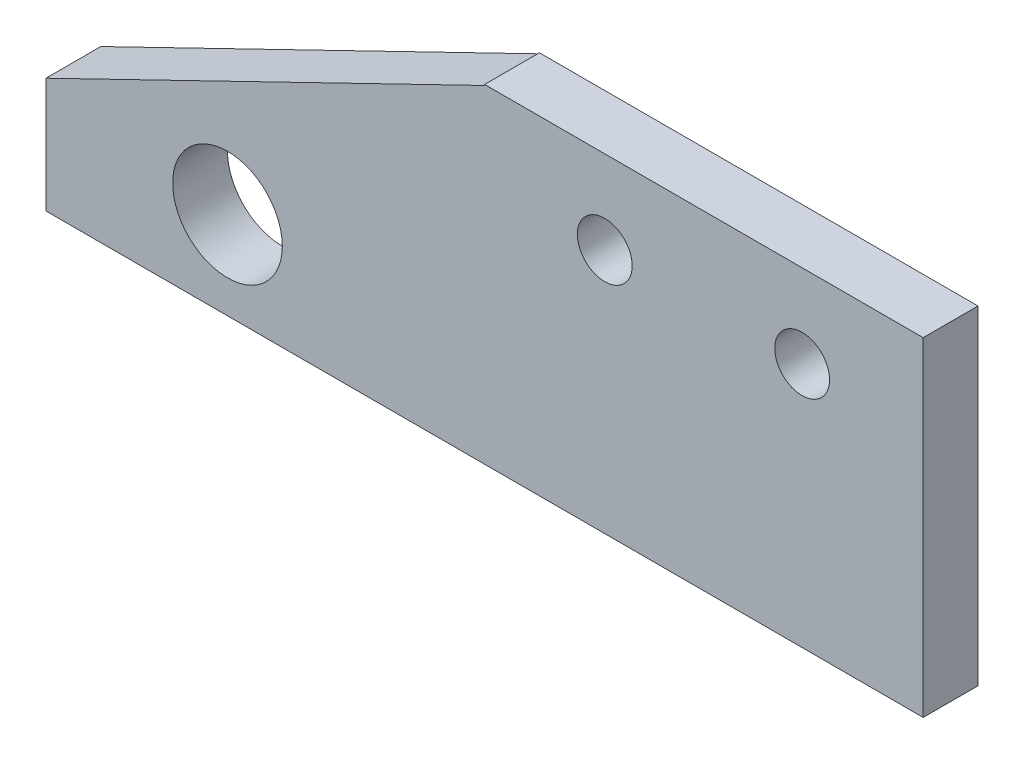
ISO-10303-21;
HEADER;
FILE_DESCRIPTION(('STEP AP214'),'2;1');
FILE_NAME('part.step','',(''),(''),'','','');
FILE_SCHEMA(('AUTOMOTIVE_DESIGN { 1 0 10303 214 1 1 1 1 }'));
ENDSEC;
DATA;
#1=APPLICATION_CONTEXT('core data for automotive mechanical design processes');
#2=APPLICATION_PROTOCOL_DEFINITION('international standard','automotive_design',2000,#1);
#3=PRODUCT_CONTEXT('',#1,'mechanical');
#4=PRODUCT('Part','Part','',(#3));
#5=PRODUCT_RELATED_PRODUCT_CATEGORY('part','',(#4));
#6=PRODUCT_DEFINITION_FORMATION('','',#4);
#7=PRODUCT_DEFINITION_CONTEXT('part definition',#1,'design');
#8=PRODUCT_DEFINITION('design','',#6,#7);
#9=PRODUCT_DEFINITION_SHAPE('','',#8);
#10=(LENGTH_UNIT() NAMED_UNIT(*) SI_UNIT(.MILLI.,.METRE.));
#11=(NAMED_UNIT(*) PLANE_ANGLE_UNIT() SI_UNIT($,.RADIAN.));
#12=(NAMED_UNIT(*) SI_UNIT($,.STERADIAN.) SOLID_ANGLE_UNIT());
#13=UNCERTAINTY_MEASURE_WITH_UNIT(LENGTH_MEASURE(1.E-05),#10,'distance_accuracy_value','');
#14=(GEOMETRIC_REPRESENTATION_CONTEXT(3) GLOBAL_UNCERTAINTY_ASSIGNED_CONTEXT((#13)) GLOBAL_UNIT_ASSIGNED_CONTEXT((#10,
#11,#12)) REPRESENTATION_CONTEXT('',''));
#15=CARTESIAN_POINT('',(0.,0.,0.));
#16=DIRECTION('',(0.,0.,1.));
#17=DIRECTION('',(1.,0.,0.));
#18=AXIS2_PLACEMENT_3D('',#15,#16,#17);
#19=CARTESIAN_POINT('',(0.,-9.525,3.175));
#20=DIRECTION('',(0.,-1.,0.));
#21=DIRECTION('',(1.,0.,0.));
#22=AXIS2_PLACEMENT_3D('',#19,#20,#21);
#23=PLANE('',#22);
#24=DIRECTION('',(-1.,0.,0.));
#25=VECTOR('',#24,1.);
#26=CARTESIAN_POINT('',(0.,-9.525,0.));
#27=LINE('',#26,#25);
#28=CARTESIAN_POINT('',(12.7,-9.525,0.));
#29=VERTEX_POINT('',#28);
#30=CARTESIAN_POINT('',(-38.1,-9.525,0.));
#31=VERTEX_POINT('',#30);
#32=EDGE_CURVE('E131',#29,#31,#27,.T.);
#33=ORIENTED_EDGE('',*,*,#32,.F.);
#34=DIRECTION('',(0.,0.,-1.));
#35=VECTOR('',#34,1.);
#36=CARTESIAN_POINT('',(12.7,-9.525,3.175));
#37=LINE('',#36,#35);
#38=CARTESIAN_POINT('',(12.7,-9.525,3.175));
#39=VERTEX_POINT('',#38);
#40=EDGE_CURVE('E11',#39,#29,#37,.T.);
#41=ORIENTED_EDGE('',*,*,#40,.F.);
#42=DIRECTION('',(-1.,0.,0.));
#43=VECTOR('',#42,1.);
#44=CARTESIAN_POINT('',(0.,-9.525,3.175));
#45=LINE('',#44,#43);
#46=CARTESIAN_POINT('',(-38.1,-9.525,3.175));
#47=VERTEX_POINT('',#46);
#48=EDGE_CURVE('E193',#39,#47,#45,.T.);
#49=ORIENTED_EDGE('',*,*,#48,.T.);
#50=DIRECTION('',(0.,0.,-1.));
#51=VECTOR('',#50,1.);
#52=CARTESIAN_POINT('',(-38.1,-9.525,3.175));
#53=LINE('',#52,#51);
#54=EDGE_CURVE('E80',#47,#31,#53,.T.);
#55=ORIENTED_EDGE('',*,*,#54,.T.);
#56=EDGE_LOOP('',(#33,#41,#49,#55));
#57=FACE_BOUND('',#56,.T.);
#58=ADVANCED_FACE('F35',(#57),#23,.T.);
#59=CARTESIAN_POINT('',(12.7,0.,3.175));
#60=DIRECTION('',(1.,0.,0.));
#61=DIRECTION('',(0.,1.,0.));
#62=AXIS2_PLACEMENT_3D('',#59,#60,#61);
#63=PLANE('',#62);
#64=DIRECTION('',(0.,-1.,0.));
#65=VECTOR('',#64,1.);
#66=CARTESIAN_POINT('',(12.7,0.,0.));
#67=LINE('',#66,#65);
#68=CARTESIAN_POINT('',(12.7,9.525,0.));
#69=VERTEX_POINT('',#68);
#70=EDGE_CURVE('E129',#69,#29,#67,.T.);
#71=ORIENTED_EDGE('',*,*,#70,.F.);
#72=DIRECTION('',(0.,0.,-1.));
#73=VECTOR('',#72,1.);
#74=CARTESIAN_POINT('',(12.7,9.525,3.175));
#75=LINE('',#74,#73);
#76=CARTESIAN_POINT('',(12.7,9.525,3.175));
#77=VERTEX_POINT('',#76);
#78=EDGE_CURVE('E44',#77,#69,#75,.T.);
#79=ORIENTED_EDGE('',*,*,#78,.F.);
#80=DIRECTION('',(0.,-1.,0.));
#81=VECTOR('',#80,1.);
#82=CARTESIAN_POINT('',(12.7,0.,3.175));
#83=LINE('',#82,#81);
#84=EDGE_CURVE('E195',#77,#39,#83,.T.);
#85=ORIENTED_EDGE('',*,*,#84,.T.);
#86=ORIENTED_EDGE('',*,*,#40,.T.);
#87=EDGE_LOOP('',(#71,#79,#85,#86));
#88=FACE_BOUND('',#87,.T.);
#89=ADVANCED_FACE('F130',(#88),#63,.T.);
#90=CARTESIAN_POINT('',(0.,9.525,3.175));
#91=DIRECTION('',(0.,1.,0.));
#92=DIRECTION('',(0.,0.,1.));
#93=AXIS2_PLACEMENT_3D('',#90,#91,#92);
#94=PLANE('',#93);
#95=DIRECTION('',(1.,0.,0.));
#96=VECTOR('',#95,1.);
#97=CARTESIAN_POINT('',(0.,9.525,0.));
#98=LINE('',#97,#96);
#99=CARTESIAN_POINT('',(-12.7,9.525,0.));
#100=VERTEX_POINT('',#99);
#101=EDGE_CURVE('E125',#100,#69,#98,.T.);
#102=ORIENTED_EDGE('',*,*,#101,.F.);
#103=DIRECTION('',(0.,0.,-1.));
#104=VECTOR('',#103,1.);
#105=CARTESIAN_POINT('',(-12.7,9.525,3.175));
#106=LINE('',#105,#104);
#107=CARTESIAN_POINT('',(-12.7,9.525,3.175));
#108=VERTEX_POINT('',#107);
#109=EDGE_CURVE('E115',#108,#100,#106,.T.);
#110=ORIENTED_EDGE('',*,*,#109,.F.);
#111=DIRECTION('',(1.,0.,0.));
#112=VECTOR('',#111,1.);
#113=CARTESIAN_POINT('',(0.,9.525,3.175));
#114=LINE('',#113,#112);
#115=EDGE_CURVE('E109',#108,#77,#114,.T.);
#116=ORIENTED_EDGE('',*,*,#115,.T.);
#117=ORIENTED_EDGE('',*,*,#78,.T.);
#118=EDGE_LOOP('',(#102,#110,#116,#117));
#119=FACE_BOUND('',#118,.T.);
#120=ADVANCED_FACE('F123',(#119),#94,.T.);
#121=CARTESIAN_POINT('',(-12.7,0.,3.175));
#122=DIRECTION('',(1.,0.,0.));
#123=DIRECTION('',(0.,1.,0.));
#124=AXIS2_PLACEMENT_3D('',#121,#122,#123);
#125=PLANE('',#124);
#126=DIRECTION('',(0.,-1.,0.));
#127=VECTOR('',#126,1.);
#128=CARTESIAN_POINT('',(-12.7,0.,0.));
#129=LINE('',#128,#127);
#130=CARTESIAN_POINT('',(-12.7,9.47226002018128,0.));
#131=VERTEX_POINT('',#130);
#132=EDGE_CURVE('E114',#100,#131,#129,.T.);
#133=ORIENTED_EDGE('',*,*,#132,.T.);
#134=DIRECTION('',(0.,0.,-1.));
#135=VECTOR('',#134,1.);
#136=CARTESIAN_POINT('',(-12.7,9.47226002018128,3.175));
#137=LINE('',#136,#135);
#138=CARTESIAN_POINT('',(-12.7,9.47226002018128,3.175));
#139=VERTEX_POINT('',#138);
#140=EDGE_CURVE('E98',#139,#131,#137,.T.);
#141=ORIENTED_EDGE('',*,*,#140,.F.);
#142=DIRECTION('',(0.,-1.,0.));
#143=VECTOR('',#142,1.);
#144=CARTESIAN_POINT('',(-12.7,0.,3.175));
#145=LINE('',#144,#143);
#146=EDGE_CURVE('E101',#108,#139,#145,.T.);
#147=ORIENTED_EDGE('',*,*,#146,.F.);
#148=ORIENTED_EDGE('',*,*,#109,.T.);
#149=EDGE_LOOP('',(#133,#141,#147,#148));
#150=FACE_BOUND('',#149,.T.);
#151=ADVANCED_FACE('F112',(#150),#125,.F.);
#152=CARTESIAN_POINT('',(-6.14546416507112,12.6551951420814,3.175));
#153=DIRECTION('',(0.436826611912576,-0.899545724866157,0.));
#154=DIRECTION('',(0.899545724866157,0.436826611912576,0.));
#155=AXIS2_PLACEMENT_3D('',#152,#153,#154);
#156=PLANE('',#155);
#157=DIRECTION('',(-0.899545724866157,-0.436826611912576,0.));
#158=VECTOR('',#157,1.);
#159=CARTESIAN_POINT('',(-6.14546416507112,12.6551951420814,0.));
#160=LINE('',#159,#158);
#161=CARTESIAN_POINT('',(-38.1,-2.86218350600002,0.));
#162=VERTEX_POINT('',#161);
#163=EDGE_CURVE('E136',#131,#162,#160,.T.);
#164=ORIENTED_EDGE('',*,*,#163,.T.);
#165=DIRECTION('',(0.,0.,-1.));
#166=VECTOR('',#165,1.);
#167=CARTESIAN_POINT('',(-38.1,-2.86218350600002,3.175));
#168=LINE('',#167,#166);
#169=CARTESIAN_POINT('',(-38.1,-2.86218350600002,3.175));
#170=VERTEX_POINT('',#169);
#171=EDGE_CURVE('E100',#170,#162,#168,.T.);
#172=ORIENTED_EDGE('',*,*,#171,.F.);
#173=DIRECTION('',(-0.899545724866157,-0.436826611912576,0.));
#174=VECTOR('',#173,1.);
#175=CARTESIAN_POINT('',(-6.14546416507112,12.6551951420814,3.175));
#176=LINE('',#175,#174);
#177=EDGE_CURVE('E93',#139,#170,#176,.T.);
#178=ORIENTED_EDGE('',*,*,#177,.F.);
#179=ORIENTED_EDGE('',*,*,#140,.T.);
#180=EDGE_LOOP('',(#164,#172,#178,#179));
#181=FACE_BOUND('',#180,.T.);
#182=ADVANCED_FACE('F96',(#181),#156,.F.);
#183=CARTESIAN_POINT('',(5.6896,4.699,3.175));
#184=DIRECTION('',(0.,0.,-1.));
#185=DIRECTION('',(-1.,0.,0.));
#186=AXIS2_PLACEMENT_3D('',#183,#184,#185);
#187=CYLINDRICAL_SURFACE('',#186,1.5875);
#188=CARTESIAN_POINT('',(5.6896,4.699,3.175));
#189=DIRECTION('',(0.,0.,1.));
#190=DIRECTION('',(1.,0.,0.));
#191=AXIS2_PLACEMENT_3D('',#188,#189,#190);
#192=CIRCLE('',#191,1.5875);
#193=CARTESIAN_POINT('',(7.2771,4.699,3.175));
#194=VERTEX_POINT('',#193);
#195=EDGE_CURVE('E150',#194,#194,#192,.T.);
#196=ORIENTED_EDGE('',*,*,#195,.T.);
#197=EDGE_LOOP('',(#196));
#198=FACE_BOUND('',#197,.T.);
#199=CARTESIAN_POINT('',(5.6896,4.699,0.));
#200=DIRECTION('',(0.,0.,1.));
#201=DIRECTION('',(1.,0.,0.));
#202=AXIS2_PLACEMENT_3D('',#199,#200,#201);
#203=CIRCLE('',#202,1.5875);
#204=CARTESIAN_POINT('',(7.2771,4.699,0.));
#205=VERTEX_POINT('',#204);
#206=EDGE_CURVE('E142',#205,#205,#203,.T.);
#207=ORIENTED_EDGE('',*,*,#206,.F.);
#208=EDGE_LOOP('',(#207));
#209=FACE_BOUND('',#208,.T.);
#210=ADVANCED_FACE('F172',(#198,#209),#187,.F.);
#211=CARTESIAN_POINT('',(-38.1,0.,3.175));
#212=DIRECTION('',(1.,0.,0.));
#213=DIRECTION('',(0.,1.,0.));
#214=AXIS2_PLACEMENT_3D('',#211,#212,#213);
#215=PLANE('',#214);
#216=DIRECTION('',(0.,-1.,0.));
#217=VECTOR('',#216,1.);
#218=CARTESIAN_POINT('',(-38.1,0.,0.));
#219=LINE('',#218,#217);
#220=EDGE_CURVE('E73',#162,#31,#219,.T.);
#221=ORIENTED_EDGE('',*,*,#220,.T.);
#222=ORIENTED_EDGE('',*,*,#54,.F.);
#223=DIRECTION('',(0.,-1.,0.));
#224=VECTOR('',#223,1.);
#225=CARTESIAN_POINT('',(-38.1,0.,3.175));
#226=LINE('',#225,#224);
#227=EDGE_CURVE('E52',#170,#47,#226,.T.);
#228=ORIENTED_EDGE('',*,*,#227,.F.);
#229=ORIENTED_EDGE('',*,*,#171,.T.);
#230=EDGE_LOOP('',(#221,#222,#228,#229));
#231=FACE_BOUND('',#230,.T.);
#232=ADVANCED_FACE('F173',(#231),#215,.F.);
#233=CARTESIAN_POINT('',(-27.5895597241903,-4.445,3.175));
#234=DIRECTION('',(0.,0.,-1.));
#235=DIRECTION('',(-1.,0.,0.));
#236=AXIS2_PLACEMENT_3D('',#233,#234,#235);
#237=CYLINDRICAL_SURFACE('',#236,3.175);
#238=CARTESIAN_POINT('',(-27.5895597241903,-4.445,3.175));
#239=DIRECTION('',(0.,0.,1.));
#240=DIRECTION('',(1.,0.,0.));
#241=AXIS2_PLACEMENT_3D('',#238,#239,#240);
#242=CIRCLE('',#241,3.175);
#243=CARTESIAN_POINT('',(-24.4145597241903,-4.445,3.175));
#244=VERTEX_POINT('',#243);
#245=EDGE_CURVE('E147',#244,#244,#242,.T.);
#246=ORIENTED_EDGE('',*,*,#245,.T.);
#247=EDGE_LOOP('',(#246));
#248=FACE_BOUND('',#247,.T.);
#249=CARTESIAN_POINT('',(-27.5895597241903,-4.445,0.));
#250=DIRECTION('',(0.,0.,1.));
#251=DIRECTION('',(1.,0.,0.));
#252=AXIS2_PLACEMENT_3D('',#249,#250,#251);
#253=CIRCLE('',#252,3.175);
#254=CARTESIAN_POINT('',(-24.4145597241903,-4.445,0.));
#255=VERTEX_POINT('',#254);
#256=EDGE_CURVE('E158',#255,#255,#253,.T.);
#257=ORIENTED_EDGE('',*,*,#256,.F.);
#258=EDGE_LOOP('',(#257));
#259=FACE_BOUND('',#258,.T.);
#260=ADVANCED_FACE('F37',(#248,#259),#237,.F.);
#261=CARTESIAN_POINT('',(-5.7404,4.699,3.175));
#262=DIRECTION('',(0.,0.,-1.));
#263=DIRECTION('',(-1.,0.,0.));
#264=AXIS2_PLACEMENT_3D('',#261,#262,#263);
#265=CYLINDRICAL_SURFACE('',#264,1.5875);
#266=CARTESIAN_POINT('',(-5.7404,4.699,3.175));
#267=DIRECTION('',(0.,0.,1.));
#268=DIRECTION('',(1.,0.,0.));
#269=AXIS2_PLACEMENT_3D('',#266,#267,#268);
#270=CIRCLE('',#269,1.5875);
#271=CARTESIAN_POINT('',(-4.1529,4.699,3.175));
#272=VERTEX_POINT('',#271);
#273=EDGE_CURVE('E148',#272,#272,#270,.T.);
#274=ORIENTED_EDGE('',*,*,#273,.T.);
#275=EDGE_LOOP('',(#274));
#276=FACE_BOUND('',#275,.T.);
#277=CARTESIAN_POINT('',(-5.7404,4.699,0.));
#278=DIRECTION('',(0.,0.,1.));
#279=DIRECTION('',(1.,0.,0.));
#280=AXIS2_PLACEMENT_3D('',#277,#278,#279);
#281=CIRCLE('',#280,1.5875);
#282=CARTESIAN_POINT('',(-4.1529,4.699,0.));
#283=VERTEX_POINT('',#282);
#284=EDGE_CURVE('E145',#283,#283,#281,.T.);
#285=ORIENTED_EDGE('',*,*,#284,.F.);
#286=EDGE_LOOP('',(#285));
#287=FACE_BOUND('',#286,.T.);
#288=ADVANCED_FACE('F180',(#276,#287),#265,.F.);
#289=CARTESIAN_POINT('',(0.,0.,3.175));
#290=DIRECTION('',(0.,0.,1.));
#291=DIRECTION('',(1.,0.,0.));
#292=AXIS2_PLACEMENT_3D('',#289,#290,#291);
#293=PLANE('',#292);
#294=ORIENTED_EDGE('',*,*,#245,.F.);
#295=EDGE_LOOP('',(#294));
#296=FACE_BOUND('',#295,.T.);
#297=ORIENTED_EDGE('',*,*,#48,.F.);
#298=ORIENTED_EDGE('',*,*,#84,.F.);
#299=ORIENTED_EDGE('',*,*,#115,.F.);
#300=ORIENTED_EDGE('',*,*,#146,.T.);
#301=ORIENTED_EDGE('',*,*,#177,.T.);
#302=ORIENTED_EDGE('',*,*,#227,.T.);
#303=EDGE_LOOP('',(#297,#298,#299,#300,#301,#302));
#304=FACE_BOUND('',#303,.T.);
#305=ORIENTED_EDGE('',*,*,#195,.F.);
#306=EDGE_LOOP('',(#305));
#307=FACE_BOUND('',#306,.T.);
#308=ORIENTED_EDGE('',*,*,#273,.F.);
#309=EDGE_LOOP('',(#308));
#310=FACE_BOUND('',#309,.T.);
#311=ADVANCED_FACE('F105',(#296,#304,#307,#310),#293,.T.);
#312=CARTESIAN_POINT('',(0.,0.,0.));
#313=DIRECTION('',(0.,0.,1.));
#314=DIRECTION('',(1.,0.,0.));
#315=AXIS2_PLACEMENT_3D('',#312,#313,#314);
#316=PLANE('',#315);
#317=ORIENTED_EDGE('',*,*,#256,.T.);
#318=EDGE_LOOP('',(#317));
#319=FACE_BOUND('',#318,.T.);
#320=ORIENTED_EDGE('',*,*,#32,.T.);
#321=ORIENTED_EDGE('',*,*,#220,.F.);
#322=ORIENTED_EDGE('',*,*,#163,.F.);
#323=ORIENTED_EDGE('',*,*,#132,.F.);
#324=ORIENTED_EDGE('',*,*,#101,.T.);
#325=ORIENTED_EDGE('',*,*,#70,.T.);
#326=EDGE_LOOP('',(#320,#321,#322,#323,#324,#325));
#327=FACE_BOUND('',#326,.T.);
#328=ORIENTED_EDGE('',*,*,#206,.T.);
#329=EDGE_LOOP('',(#328));
#330=FACE_BOUND('',#329,.T.);
#331=ORIENTED_EDGE('',*,*,#284,.T.);
#332=EDGE_LOOP('',(#331));
#333=FACE_BOUND('',#332,.T.);
#334=ADVANCED_FACE('F133',(#319,#327,#330,#333),#316,.F.);
#335=CLOSED_SHELL('',(#58,#89,#120,#151,#182,#210,#232,#260,#288,#311,#334));
#336=MANIFOLD_SOLID_BREP('B2',#335);
#337=ADVANCED_BREP_SHAPE_REPRESENTATION('',(#18,#336),#14);
#338=SHAPE_DEFINITION_REPRESENTATION(#9,#337);
ENDSEC;
END-ISO-10303-21;
